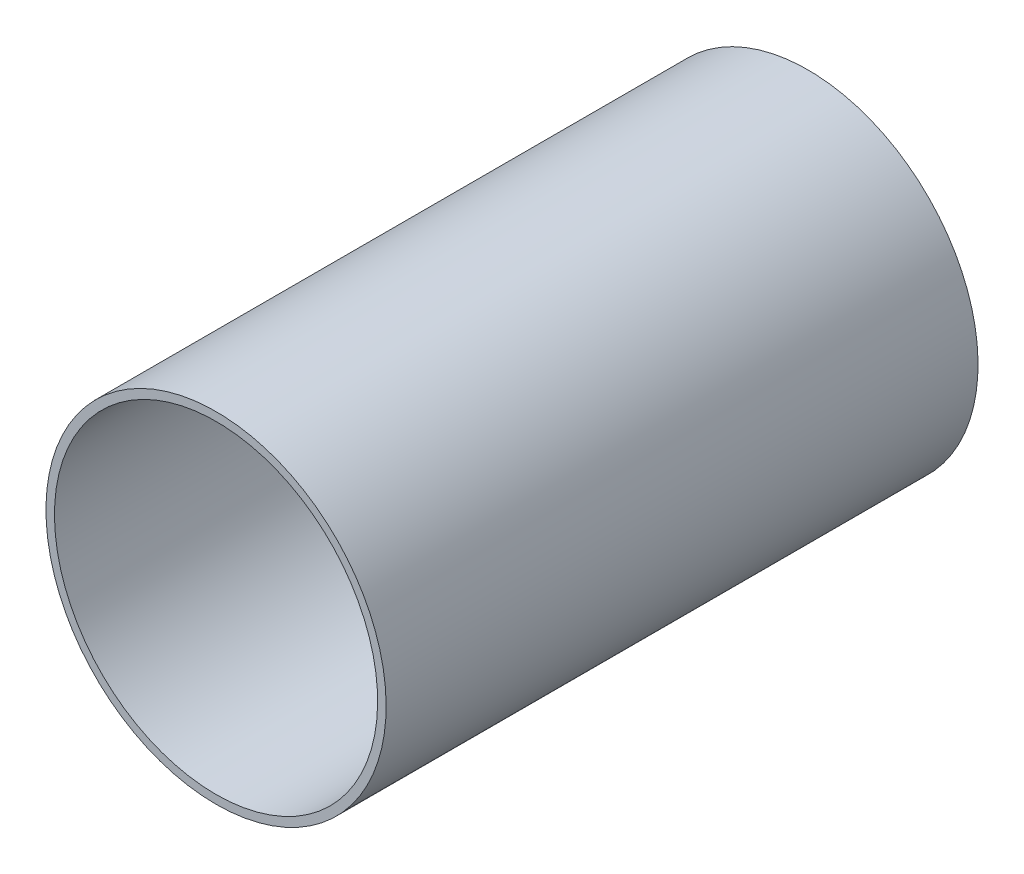
ISO-10303-21;
HEADER;
FILE_DESCRIPTION(('STEP AP214'),'2;1');
FILE_NAME('part.step','',(''),(''),'','','');
FILE_SCHEMA(('AUTOMOTIVE_DESIGN { 1 0 10303 214 1 1 1 1 }'));
ENDSEC;
DATA;
#1=APPLICATION_CONTEXT('core data for automotive mechanical design processes');
#2=APPLICATION_PROTOCOL_DEFINITION('international standard','automotive_design',2000,#1);
#3=PRODUCT_CONTEXT('',#1,'mechanical');
#4=PRODUCT('Part','Part','',(#3));
#5=PRODUCT_RELATED_PRODUCT_CATEGORY('part','',(#4));
#6=PRODUCT_DEFINITION_FORMATION('','',#4);
#7=PRODUCT_DEFINITION_CONTEXT('part definition',#1,'design');
#8=PRODUCT_DEFINITION('design','',#6,#7);
#9=PRODUCT_DEFINITION_SHAPE('','',#8);
#10=(LENGTH_UNIT() NAMED_UNIT(*) SI_UNIT(.MILLI.,.METRE.));
#11=(NAMED_UNIT(*) PLANE_ANGLE_UNIT() SI_UNIT($,.RADIAN.));
#12=(NAMED_UNIT(*) SI_UNIT($,.STERADIAN.) SOLID_ANGLE_UNIT());
#13=UNCERTAINTY_MEASURE_WITH_UNIT(LENGTH_MEASURE(1.E-05),#10,'distance_accuracy_value','');
#14=(GEOMETRIC_REPRESENTATION_CONTEXT(3) GLOBAL_UNCERTAINTY_ASSIGNED_CONTEXT((#13)) GLOBAL_UNIT_ASSIGNED_CONTEXT((#10,
#11,#12)) REPRESENTATION_CONTEXT('',''));
#15=CARTESIAN_POINT('',(0.,0.,0.));
#16=DIRECTION('',(0.,0.,1.));
#17=DIRECTION('',(1.,0.,0.));
#18=AXIS2_PLACEMENT_3D('',#15,#16,#17);
#19=CARTESIAN_POINT('',(113.792,-122.169,-0.045));
#20=DIRECTION('',(0.,0.,-1.));
#21=DIRECTION('',(0.,-1.,0.));
#22=AXIS2_PLACEMENT_3D('',#19,#20,#21);
#23=CYLINDRICAL_SURFACE('',#22,0.475);
#24=CARTESIAN_POINT('',(113.792,-122.169,-0.035));
#25=DIRECTION('',(0.,0.,-1.));
#26=DIRECTION('',(0.,-1.,0.));
#27=AXIS2_PLACEMENT_3D('',#24,#25,#26);
#28=CIRCLE('',#27,0.475);
#29=CARTESIAN_POINT('',(113.792,-122.644,-0.035));
#30=VERTEX_POINT('',#29);
#31=EDGE_CURVE('E20',#30,#30,#28,.T.);
#32=ORIENTED_EDGE('',*,*,#31,.T.);
#33=DIRECTION('',(0.,0.,1.));
#34=VECTOR('',#33,1.);
#35=CARTESIAN_POINT('',(113.792,-122.644,-0.045));
#36=LINE('',#35,#34);
#37=CARTESIAN_POINT('',(113.792,-122.644,1.705));
#38=VERTEX_POINT('',#37);
#39=EDGE_CURVE('E11',#30,#38,#36,.T.);
#40=ORIENTED_EDGE('',*,*,#39,.T.);
#41=CARTESIAN_POINT('',(113.792,-122.169,1.705));
#42=DIRECTION('',(0.,0.,-1.));
#43=DIRECTION('',(0.,-1.,0.));
#44=AXIS2_PLACEMENT_3D('',#41,#42,#43);
#45=CIRCLE('',#44,0.475);
#46=EDGE_CURVE('E26',#38,#38,#45,.T.);
#47=ORIENTED_EDGE('',*,*,#46,.F.);
#48=ORIENTED_EDGE('',*,*,#39,.F.);
#49=EDGE_LOOP('',(#32,#40,#47,#48));
#50=FACE_BOUND('',#49,.T.);
#51=ADVANCED_FACE('F17',(#50),#23,.F.);
#52=CARTESIAN_POINT('',(113.792,-122.669,1.705));
#53=DIRECTION('',(0.,0.,1.));
#54=DIRECTION('',(1.,0.,0.));
#55=AXIS2_PLACEMENT_3D('',#52,#53,#54);
#56=PLANE('',#55);
#57=ORIENTED_EDGE('',*,*,#46,.T.);
#58=EDGE_LOOP('',(#57));
#59=FACE_BOUND('',#58,.T.);
#60=CARTESIAN_POINT('',(113.792,-122.169,1.705));
#61=DIRECTION('',(0.,0.,1.));
#62=DIRECTION('',(0.,-1.,0.));
#63=AXIS2_PLACEMENT_3D('',#60,#61,#62);
#64=CIRCLE('',#63,0.5);
#65=CARTESIAN_POINT('',(113.792,-122.669,1.705));
#66=VERTEX_POINT('',#65);
#67=EDGE_CURVE('E57',#66,#66,#64,.T.);
#68=ORIENTED_EDGE('',*,*,#67,.T.);
#69=EDGE_LOOP('',(#68));
#70=FACE_BOUND('',#69,.T.);
#71=ADVANCED_FACE('F79',(#59,#70),#56,.T.);
#72=CARTESIAN_POINT('',(113.792,-122.669,-0.035));
#73=DIRECTION('',(0.,0.,1.));
#74=DIRECTION('',(1.,0.,0.));
#75=AXIS2_PLACEMENT_3D('',#72,#73,#74);
#76=PLANE('',#75);
#77=ORIENTED_EDGE('',*,*,#31,.F.);
#78=EDGE_LOOP('',(#77));
#79=FACE_BOUND('',#78,.T.);
#80=CARTESIAN_POINT('',(113.792,-122.169,-0.035));
#81=DIRECTION('',(0.,0.,1.));
#82=DIRECTION('',(0.,-1.,0.));
#83=AXIS2_PLACEMENT_3D('',#80,#81,#82);
#84=CIRCLE('',#83,0.5);
#85=CARTESIAN_POINT('',(113.792,-122.669,-0.035));
#86=VERTEX_POINT('',#85);
#87=EDGE_CURVE('E56',#86,#86,#84,.T.);
#88=ORIENTED_EDGE('',*,*,#87,.F.);
#89=EDGE_LOOP('',(#88));
#90=FACE_BOUND('',#89,.T.);
#91=ADVANCED_FACE('F76',(#79,#90),#76,.F.);
#92=CARTESIAN_POINT('',(113.792,-122.169,-0.035));
#93=DIRECTION('',(0.,0.,-1.));
#94=DIRECTION('',(0.,-1.,0.));
#95=AXIS2_PLACEMENT_3D('',#92,#93,#94);
#96=CYLINDRICAL_SURFACE('',#95,0.5);
#97=ORIENTED_EDGE('',*,*,#87,.T.);
#98=DIRECTION('',(0.,0.,1.));
#99=VECTOR('',#98,1.);
#100=CARTESIAN_POINT('',(113.792,-122.669,-0.035));
#101=LINE('',#100,#99);
#102=EDGE_CURVE('E53',#86,#66,#101,.T.);
#103=ORIENTED_EDGE('',*,*,#102,.T.);
#104=ORIENTED_EDGE('',*,*,#67,.F.);
#105=ORIENTED_EDGE('',*,*,#102,.F.);
#106=EDGE_LOOP('',(#97,#103,#104,#105));
#107=FACE_BOUND('',#106,.T.);
#108=ADVANCED_FACE('F54',(#107),#96,.T.);
#109=CLOSED_SHELL('',(#51,#71,#91,#108));
#110=MANIFOLD_SOLID_BREP('B1',#109);
#111=ADVANCED_BREP_SHAPE_REPRESENTATION('',(#18,#110),#14);
#112=SHAPE_DEFINITION_REPRESENTATION(#9,#111);
ENDSEC;
END-ISO-10303-21;
